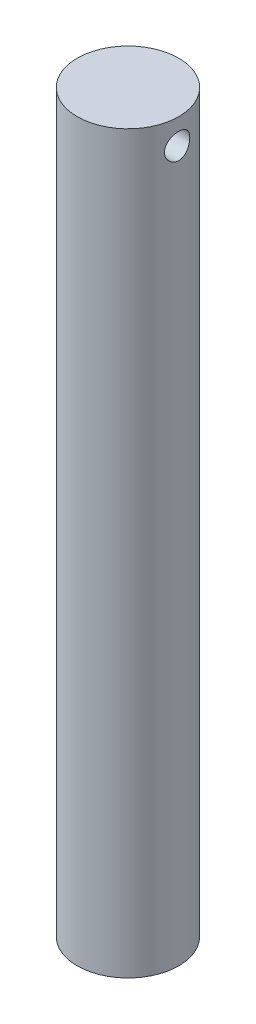
ISO-10303-21;
HEADER;
FILE_DESCRIPTION(('STEP AP214'),'2;1');
FILE_NAME('part.step','',(''),(''),'','','');
FILE_SCHEMA(('AUTOMOTIVE_DESIGN { 1 0 10303 214 1 1 1 1 }'));
ENDSEC;
DATA;
#1=APPLICATION_CONTEXT('core data for automotive mechanical design processes');
#2=APPLICATION_PROTOCOL_DEFINITION('international standard','automotive_design',2000,#1);
#3=PRODUCT_CONTEXT('',#1,'mechanical');
#4=PRODUCT('Part','Part','',(#3));
#5=PRODUCT_RELATED_PRODUCT_CATEGORY('part','',(#4));
#6=PRODUCT_DEFINITION_FORMATION('','',#4);
#7=PRODUCT_DEFINITION_CONTEXT('part definition',#1,'design');
#8=PRODUCT_DEFINITION('design','',#6,#7);
#9=PRODUCT_DEFINITION_SHAPE('','',#8);
#10=(LENGTH_UNIT() NAMED_UNIT(*) SI_UNIT(.MILLI.,.METRE.));
#11=(NAMED_UNIT(*) PLANE_ANGLE_UNIT() SI_UNIT($,.RADIAN.));
#12=(NAMED_UNIT(*) SI_UNIT($,.STERADIAN.) SOLID_ANGLE_UNIT());
#13=UNCERTAINTY_MEASURE_WITH_UNIT(LENGTH_MEASURE(1.E-05),#10,'distance_accuracy_value','');
#14=(GEOMETRIC_REPRESENTATION_CONTEXT(3) GLOBAL_UNCERTAINTY_ASSIGNED_CONTEXT((#13)) GLOBAL_UNIT_ASSIGNED_CONTEXT((#10,
#11,#12)) REPRESENTATION_CONTEXT('',''));
#15=CARTESIAN_POINT('',(0.,0.,0.));
#16=DIRECTION('',(0.,0.,1.));
#17=DIRECTION('',(1.,0.,0.));
#18=AXIS2_PLACEMENT_3D('',#15,#16,#17);
#19=CARTESIAN_POINT('',(0.,184.15,0.));
#20=DIRECTION('',(0.,-1.,0.));
#21=DIRECTION('',(0.,0.,-1.));
#22=AXIS2_PLACEMENT_3D('',#19,#20,#21);
#23=CYLINDRICAL_SURFACE('',#22,12.7);
#24=CARTESIAN_POINT('',(-12.2967221242086,177.8,-3.175));
#25=CARTESIAN_POINT('',(-12.2967254711158,177.975324453677,-3.1749950198132));
#26=CARTESIAN_POINT('',(-12.3005126863854,178.150704021322,-3.160428331782));
#27=CARTESIAN_POINT('',(-12.3152136473056,178.49642682428,-3.10263936933901));
#28=CARTESIAN_POINT('',(-12.3261315404947,178.666767068175,-3.05940041756249));
#29=CARTESIAN_POINT('',(-12.3537818023711,178.997360493498,-2.94575382353269));
#30=CARTESIAN_POINT('',(-12.3705066621688,179.15762638734,-2.87538125437516));
#31=CARTESIAN_POINT('',(-12.4078770387652,179.464094782726,-2.7095718494019));
#32=CARTESIAN_POINT('',(-12.4285227220068,179.610296686842,-2.61413394947205));
#33=CARTESIAN_POINT('',(-12.4719170977164,179.887704289483,-2.39865970268607));
#34=CARTESIAN_POINT('',(-12.4946993898125,180.018554872445,-2.27817284738409));
#35=CARTESIAN_POINT('',(-12.5395085190442,180.258416970838,-2.0169912214078));
#36=CARTESIAN_POINT('',(-12.5615352853931,180.36742644454,-1.87629456360899));
#37=CARTESIAN_POINT('',(-12.6027232771114,180.561964843892,-1.57625440537029));
#38=CARTESIAN_POINT('',(-12.6218402299875,180.647144912965,-1.41667811176779));
#39=CARTESIAN_POINT('',(-12.65467131146,180.789338248074,-1.08491424405177));
#40=CARTESIAN_POINT('',(-12.6683862371462,180.846355669933,-0.91272853495574));
#41=CARTESIAN_POINT('',(-12.6886304373719,180.929467749915,-0.56433562361777));
#42=CARTESIAN_POINT('',(-12.6952996518228,180.956165448295,-0.388280553827184));
#43=CARTESIAN_POINT('',(-12.7011886451627,180.97977314168,-0.0340726004637031));
#44=CARTESIAN_POINT('',(-12.7004095254281,180.976687540706,0.144079969063361));
#45=CARTESIAN_POINT('',(-12.6915938059099,180.941249940182,0.493243384772336));
#46=CARTESIAN_POINT('',(-12.6837186297291,180.909548867182,0.664324984533387));
#47=CARTESIAN_POINT('',(-12.6617836238657,180.818826487038,0.998658935538459));
#48=CARTESIAN_POINT('',(-12.6477234649603,180.759803725571,1.16191086950116));
#49=CARTESIAN_POINT('',(-12.6147513732012,180.615586735228,1.47766628361825));
#50=CARTESIAN_POINT('',(-12.5957967501266,180.53016085328,1.63005931850864));
#51=CARTESIAN_POINT('',(-12.5550917783831,180.335738287522,1.91857510093104));
#52=CARTESIAN_POINT('',(-12.5333409435887,180.226737502928,2.05469501139649));
#53=CARTESIAN_POINT('',(-12.4887191648708,179.984769897682,2.31068256139473));
#54=CARTESIAN_POINT('',(-12.4658338379713,179.851234286718,2.43001063106372));
#55=CARTESIAN_POINT('',(-12.4220610526701,179.565808033604,2.64469999368257));
#56=CARTESIAN_POINT('',(-12.4011736876753,179.413916534046,2.74006016644615));
#57=CARTESIAN_POINT('',(-12.3637103097324,179.095031656631,2.90445230964671));
#58=CARTESIAN_POINT('',(-12.347155693206,178.927968622503,2.97335437513114));
#59=CARTESIAN_POINT('',(-12.3205067298881,178.584116455543,3.08192684552047));
#60=CARTESIAN_POINT('',(-12.3104110007027,178.40732941274,3.12160350580597));
#61=CARTESIAN_POINT('',(-12.2981130212947,178.054051433057,3.16970364110574));
#62=CARTESIAN_POINT('',(-12.295709330007,177.877676002457,3.1789249018773));
#63=CARTESIAN_POINT('',(-12.2985192607316,177.525906140537,3.16803657795425));
#64=CARTESIAN_POINT('',(-12.3037321815428,177.350511620404,3.14792969326922));
#65=CARTESIAN_POINT('',(-12.3209949412093,177.008644883516,3.0796553392016));
#66=CARTESIAN_POINT('',(-12.3329315220801,176.842073637257,3.0319523667181));
#67=CARTESIAN_POINT('',(-12.3621891219376,176.519292048527,2.91035496372155));
#68=CARTESIAN_POINT('',(-12.3795107787294,176.363082935999,2.83645743059486));
#69=CARTESIAN_POINT('',(-12.418010941113,176.062079577109,2.66289874827948));
#70=CARTESIAN_POINT('',(-12.439258441312,175.917569373146,2.56276062737135));
#71=CARTESIAN_POINT('',(-12.4830469550031,175.647110779242,2.34016643006697));
#72=CARTESIAN_POINT('',(-12.5055881806495,175.521165445855,2.21770668600727));
#73=CARTESIAN_POINT('',(-12.5501070185035,175.288179975935,1.95028413912648));
#74=CARTESIAN_POINT('',(-12.5720564161859,175.181691720563,1.80483494928784));
#75=CARTESIAN_POINT('',(-12.6123346509938,174.994651448972,1.49765601755565));
#76=CARTESIAN_POINT('',(-12.6306636769502,174.914098079908,1.33592712544036));
#77=CARTESIAN_POINT('',(-12.6615204698767,174.78191353615,1.00189729049619));
#78=CARTESIAN_POINT('',(-12.6740898412846,174.730074358839,0.829682684763512));
#79=CARTESIAN_POINT('',(-12.6921932261265,174.656165375047,0.478630489012205));
#80=CARTESIAN_POINT('',(-12.6977285972965,174.634089823401,0.299794184005929));
#81=CARTESIAN_POINT('',(-12.7010848787296,174.620657903098,-0.0542401964575542));
#82=CARTESIAN_POINT('',(-12.6991103294396,174.628487073622,-0.229405900617113));
#83=CARTESIAN_POINT('',(-12.6881222125238,174.67277685166,-0.575841801116832));
#84=CARTESIAN_POINT('',(-12.6791088542401,174.709236607667,-0.74711211315446));
#85=CARTESIAN_POINT('',(-12.655087493111,174.809315797772,-1.0800430381722));
#86=CARTESIAN_POINT('',(-12.640112022951,174.872787964273,-1.24175042029429));
#87=CARTESIAN_POINT('',(-12.6057434230086,175.024956588387,-1.55231164340718));
#88=CARTESIAN_POINT('',(-12.5863497364056,175.113656225729,-1.70116386101836));
#89=CARTESIAN_POINT('',(-12.5446551773491,175.316245867938,-1.98565112274399));
#90=CARTESIAN_POINT('',(-12.5222957878978,175.43068845372,-2.12088408784728));
#91=CARTESIAN_POINT('',(-12.4774531075658,175.680442555028,-2.37050268936846));
#92=CARTESIAN_POINT('',(-12.4549697867118,175.815759353653,-2.48488303211821));
#93=CARTESIAN_POINT('',(-12.4119473580947,176.106459490052,-2.69164443404806));
#94=CARTESIAN_POINT('',(-12.3914523466269,176.262170091685,-2.783575266647));
#95=CARTESIAN_POINT('',(-12.3553205869608,176.587326180353,-2.93981789665887));
#96=CARTESIAN_POINT('',(-12.3396803064045,176.756761567348,-3.00414978846308));
#97=CARTESIAN_POINT('',(-12.3174731028359,177.071582012577,-3.09379152821293));
#98=CARTESIAN_POINT('',(-12.3097500503611,177.215460796926,-3.12417831664509));
#99=CARTESIAN_POINT('',(-12.2993733749982,177.506213659068,-3.16478377891537));
#100=CARTESIAN_POINT('',(-12.2967193196792,177.653087480276,-3.17500417313031));
#101=CARTESIAN_POINT('',(-12.2967221242086,177.8,-3.175));
#102=B_SPLINE_CURVE_WITH_KNOTS('',3,(#24,#25,#26,#27,#28,#29,#30,#31,#32,#33,#34,#35,#36,#37,
#38,#39,#40,#41,#42,#43,#44,#45,#46,#47,#48,#49,#50,#51,#52,#53,#54,#55,#56,#57,#58,#59,#60,#61,
#62,#63,#64,#65,#66,#67,#68,#69,#70,#71,#72,#73,#74,#75,#76,#77,#78,#79,#80,#81,#82,#83,#84,#85,
#86,#87,#88,#89,#90,#91,#92,#93,#94,#95,#96,#97,#98,#99,#100,#101),.UNSPECIFIED.,.T.,.F.,(4,2,2,
2,2,2,2,2,2,2,2,2,2,2,2,2,2,2,2,2,2,2,2,2,2,2,2,2,2,2,2,2,2,2,2,2,2,2,4),(0.,0.525433851004991,
1.05117359161457,1.57623602350094,2.10132074979464,2.63682421825087,3.17237772279439,
3.71540400425363,4.2583501300581,4.79029713764094,5.32216548805849,5.84223193614965,
6.36232607040479,6.88711950303146,7.41200429545524,7.95109492546326,8.49021074623747,
9.03194068650662,9.57355464164508,10.1008633995052,10.6281236152969,11.1467570436795,
11.6654519221146,12.194322142474,12.7232793399028,13.2654717033223,13.8076357797011,
14.3458193247108,14.8838989712076,15.4074297658815,15.9309449907504,16.4516419323712,
16.9724045329365,17.5056431266552,18.0390169009448,18.5823412615974,19.1252693614627,
19.5655924052587,20.0058778838705),.UNSPECIFIED.);
#103=CARTESIAN_POINT('',(-12.2967221242086,177.8,-3.175));
#104=VERTEX_POINT('',#103);
#105=EDGE_CURVE('E10',#104,#104,#102,.T.);
#106=ORIENTED_EDGE('',*,*,#105,.T.);
#107=EDGE_LOOP('',(#106));
#108=FACE_BOUND('',#107,.T.);
#109=CARTESIAN_POINT('',(12.2967221242086,177.8,-3.175));
#110=CARTESIAN_POINT('',(12.2967254711158,177.624675546323,-3.1749950198132));
#111=CARTESIAN_POINT('',(12.3005126863854,177.449295978678,-3.160428331782));
#112=CARTESIAN_POINT('',(12.3152136473056,177.10357317572,-3.10263936933901));
#113=CARTESIAN_POINT('',(12.3261315404947,176.933232931825,-3.05940041756249));
#114=CARTESIAN_POINT('',(12.3537818023711,176.602639506502,-2.94575382353269));
#115=CARTESIAN_POINT('',(12.3705066621688,176.44237361266,-2.87538125437516));
#116=CARTESIAN_POINT('',(12.4078770387652,176.135905217274,-2.7095718494019));
#117=CARTESIAN_POINT('',(12.4285227220068,175.989703313158,-2.61413394947205));
#118=CARTESIAN_POINT('',(12.4719170977164,175.712295710517,-2.39865970268606));
#119=CARTESIAN_POINT('',(12.4946993898125,175.581445127555,-2.27817284738408));
#120=CARTESIAN_POINT('',(12.5395085190442,175.341583029162,-2.01699122140779));
#121=CARTESIAN_POINT('',(12.5615352853931,175.23257355546,-1.87629456360899));
#122=CARTESIAN_POINT('',(12.6027232771114,175.038035156108,-1.57625440537029));
#123=CARTESIAN_POINT('',(12.6218402299875,174.952855087035,-1.41667811176778));
#124=CARTESIAN_POINT('',(12.65467131146,174.810661751926,-1.08491424405177));
#125=CARTESIAN_POINT('',(12.6683862371462,174.753644330067,-0.912728534955738));
#126=CARTESIAN_POINT('',(12.6886304373719,174.670532250085,-0.564335623617774));
#127=CARTESIAN_POINT('',(12.6952996518228,174.643834551705,-0.388280553827185));
#128=CARTESIAN_POINT('',(12.7011886451627,174.62022685832,-0.0340726004637008));
#129=CARTESIAN_POINT('',(12.7004095254281,174.623312459294,0.144079969063363));
#130=CARTESIAN_POINT('',(12.6915938059099,174.658750059818,0.493243384772331));
#131=CARTESIAN_POINT('',(12.6837186297291,174.690451132818,0.664324984533374));
#132=CARTESIAN_POINT('',(12.6617836238657,174.781173512962,0.998658935538448));
#133=CARTESIAN_POINT('',(12.6477234649603,174.840196274429,1.16191086950116));
#134=CARTESIAN_POINT('',(12.6147513732012,174.984413264772,1.47766628361824));
#135=CARTESIAN_POINT('',(12.5957967501266,175.06983914672,1.63005931850862));
#136=CARTESIAN_POINT('',(12.5550917783831,175.264261712478,1.91857510093102));
#137=CARTESIAN_POINT('',(12.5333409435887,175.373262497072,2.05469501139649));
#138=CARTESIAN_POINT('',(12.4887191648708,175.615230102318,2.31068256139474));
#139=CARTESIAN_POINT('',(12.4658338379713,175.748765713282,2.43001063106372));
#140=CARTESIAN_POINT('',(12.4220610526701,176.034191966396,2.64469999368256));
#141=CARTESIAN_POINT('',(12.4011736876753,176.186083465954,2.74006016644615));
#142=CARTESIAN_POINT('',(12.3637103097323,176.504968343369,2.90445230964676));
#143=CARTESIAN_POINT('',(12.347155693206,176.672031377497,2.97335437513121));
#144=CARTESIAN_POINT('',(12.3205067298881,177.015883544458,3.08192684552053));
#145=CARTESIAN_POINT('',(12.3104110007027,177.192670587261,3.12160350580599));
#146=CARTESIAN_POINT('',(12.2981130212947,177.545948566943,3.16970364110571));
#147=CARTESIAN_POINT('',(12.2957093300071,177.722323997543,3.17892490187727));
#148=CARTESIAN_POINT('',(12.2985192607316,178.074093859464,3.16803657795425));
#149=CARTESIAN_POINT('',(12.3037321815428,178.249488379596,3.14792969326927));
#150=CARTESIAN_POINT('',(12.3209949412093,178.591355116485,3.07965533920156));
#151=CARTESIAN_POINT('',(12.3329315220802,178.757926362743,3.03195236671794));
#152=CARTESIAN_POINT('',(12.3621891219376,179.080707951474,2.91035496372141));
#153=CARTESIAN_POINT('',(12.3795107787294,179.236917064001,2.83645743059486));
#154=CARTESIAN_POINT('',(12.418010941113,179.537920422891,2.66289874827951));
#155=CARTESIAN_POINT('',(12.439258441312,179.682430626855,2.56276062737127));
#156=CARTESIAN_POINT('',(12.4830469550031,179.952889220758,2.34016643006686));
#157=CARTESIAN_POINT('',(12.5055881806495,180.078834554145,2.21770668600722));
#158=CARTESIAN_POINT('',(12.5501070185035,180.311820024065,1.95028413912649));
#159=CARTESIAN_POINT('',(12.5720564161859,180.418308279437,1.80483494928784));
#160=CARTESIAN_POINT('',(12.6123346509939,180.605348551028,1.49765601755564));
#161=CARTESIAN_POINT('',(12.6306636769502,180.685901920092,1.33592712544036));
#162=CARTESIAN_POINT('',(12.6615204698767,180.81808646385,1.00189729049619));
#163=CARTESIAN_POINT('',(12.6740898412846,180.869925641161,0.829682684763504));
#164=CARTESIAN_POINT('',(12.6921932261265,180.943834624953,0.478630489012196));
#165=CARTESIAN_POINT('',(12.6977285972965,180.965910176599,0.299794184005925));
#166=CARTESIAN_POINT('',(12.7010848787296,180.979342096903,-0.0542401964575463));
#167=CARTESIAN_POINT('',(12.6991103294396,180.971512926378,-0.229405900617098));
#168=CARTESIAN_POINT('',(12.6881222125238,180.92722314834,-0.575841801116821));
#169=CARTESIAN_POINT('',(12.6791088542401,180.890763392333,-0.747112113154459));
#170=CARTESIAN_POINT('',(12.655087493111,180.790684202228,-1.08004303817215));
#171=CARTESIAN_POINT('',(12.640112022951,180.727212035727,-1.2417504202942));
#172=CARTESIAN_POINT('',(12.6057434230086,180.575043411613,-1.55231164340713));
#173=CARTESIAN_POINT('',(12.5863497364055,180.486343774271,-1.70116386101841));
#174=CARTESIAN_POINT('',(12.5446551773491,180.283754132063,-1.98565112274402));
#175=CARTESIAN_POINT('',(12.5222957878979,180.16931154628,-2.12088408784719));
#176=CARTESIAN_POINT('',(12.4774531075658,179.919557444972,-2.37050268936833));
#177=CARTESIAN_POINT('',(12.4549697867119,179.784240646347,-2.48488303211816));
#178=CARTESIAN_POINT('',(12.4119473580947,179.493540509948,-2.69164443404808));
#179=CARTESIAN_POINT('',(12.3914523466269,179.337829908315,-2.78357526664703));
#180=CARTESIAN_POINT('',(12.3553205869608,179.012673819647,-2.93981789665889));
#181=CARTESIAN_POINT('',(12.3396803064045,178.843238432652,-3.00414978846308));
#182=CARTESIAN_POINT('',(12.3174731028359,178.528417987423,-3.09379152821293));
#183=CARTESIAN_POINT('',(12.3097500503611,178.384539203074,-3.12417831664509));
#184=CARTESIAN_POINT('',(12.2993733749982,178.093786340932,-3.16478377891537));
#185=CARTESIAN_POINT('',(12.2967193196792,177.946912519724,-3.17500417313031));
#186=CARTESIAN_POINT('',(12.2967221242086,177.8,-3.175));
#187=B_SPLINE_CURVE_WITH_KNOTS('',3,(#109,#110,#111,#112,#113,#114,#115,#116,#117,#118,#119,
#120,#121,#122,#123,#124,#125,#126,#127,#128,#129,#130,#131,#132,#133,#134,#135,#136,#137,#138,
#139,#140,#141,#142,#143,#144,#145,#146,#147,#148,#149,#150,#151,#152,#153,#154,#155,#156,#157,
#158,#159,#160,#161,#162,#163,#164,#165,#166,#167,#168,#169,#170,#171,#172,#173,#174,#175,#176,
#177,#178,#179,#180,#181,#182,#183,#184,#185,#186),.UNSPECIFIED.,.T.,.F.,(4,2,2,2,2,2,2,2,2,2,2,
2,2,2,2,2,2,2,2,2,2,2,2,2,2,2,2,2,2,2,2,2,2,2,2,2,2,2,4),(0.,0.525433851004991,1.05117359161457,
1.57623602350094,2.10132074979464,2.6368242182509,3.17237772279441,3.71540400425364,
4.25835013005812,4.79029713764095,5.3221654880585,5.84223193614965,6.36232607040479,
6.88711950303145,7.41200429545523,7.95109492546329,8.49021074623746,9.03194068650686,
9.57355464164558,10.1008633995057,10.6281236152974,11.14675704368,11.665451922115,
12.1943221424742,12.7232793399028,13.2654717033224,13.8076357797012,14.3458193247109,
14.8838989712077,15.4074297658816,15.9309449907505,16.4516419323712,16.9724045329363,
17.5056431266552,18.0390169009449,18.5823412615976,19.1252693614629,19.5655924052588,
20.0058778838707),.UNSPECIFIED.);
#188=CARTESIAN_POINT('',(12.2967221242086,177.8,-3.175));
#189=VERTEX_POINT('',#188);
#190=EDGE_CURVE('E25',#189,#189,#187,.T.);
#191=ORIENTED_EDGE('',*,*,#190,.T.);
#192=EDGE_LOOP('',(#191));
#193=FACE_BOUND('',#192,.T.);
#194=CARTESIAN_POINT('',(0.,184.15,0.));
#195=DIRECTION('',(0.,1.,0.));
#196=DIRECTION('',(0.,0.,1.));
#197=AXIS2_PLACEMENT_3D('',#194,#195,#196);
#198=CIRCLE('',#197,12.7);
#199=CARTESIAN_POINT('',(0.,184.15,12.7));
#200=VERTEX_POINT('',#199);
#201=EDGE_CURVE('E29',#200,#200,#198,.T.);
#202=ORIENTED_EDGE('',*,*,#201,.F.);
#203=EDGE_LOOP('',(#202));
#204=FACE_BOUND('',#203,.T.);
#205=CARTESIAN_POINT('',(0.,0.,0.));
#206=DIRECTION('',(0.,1.,0.));
#207=DIRECTION('',(0.,0.,1.));
#208=AXIS2_PLACEMENT_3D('',#205,#206,#207);
#209=CIRCLE('',#208,12.7);
#210=CARTESIAN_POINT('',(0.,0.,12.7));
#211=VERTEX_POINT('',#210);
#212=EDGE_CURVE('E33',#211,#211,#209,.T.);
#213=ORIENTED_EDGE('',*,*,#212,.T.);
#214=EDGE_LOOP('',(#213));
#215=FACE_BOUND('',#214,.T.);
#216=ADVANCED_FACE('F15',(#108,#193,#204,#215),#23,.T.);
#217=CARTESIAN_POINT('',(0.,184.15,0.));
#218=DIRECTION('',(0.,1.,0.));
#219=DIRECTION('',(0.,0.,1.));
#220=AXIS2_PLACEMENT_3D('',#217,#218,#219);
#221=PLANE('',#220);
#222=ORIENTED_EDGE('',*,*,#201,.T.);
#223=EDGE_LOOP('',(#222));
#224=FACE_BOUND('',#223,.T.);
#225=ADVANCED_FACE('F44',(#224),#221,.T.);
#226=CARTESIAN_POINT('',(0.,0.,0.));
#227=DIRECTION('',(0.,1.,0.));
#228=DIRECTION('',(0.,0.,1.));
#229=AXIS2_PLACEMENT_3D('',#226,#227,#228);
#230=PLANE('',#229);
#231=ORIENTED_EDGE('',*,*,#212,.F.);
#232=EDGE_LOOP('',(#231));
#233=FACE_BOUND('',#232,.T.);
#234=ADVANCED_FACE('F42',(#233),#230,.F.);
#235=CARTESIAN_POINT('',(-12.7,177.8,0.));
#236=DIRECTION('',(1.,0.,0.));
#237=DIRECTION('',(0.,0.,-1.));
#238=AXIS2_PLACEMENT_3D('',#235,#236,#237);
#239=CYLINDRICAL_SURFACE('',#238,3.175);
#240=ORIENTED_EDGE('',*,*,#190,.F.);
#241=EDGE_LOOP('',(#240));
#242=FACE_BOUND('',#241,.T.);
#243=ORIENTED_EDGE('',*,*,#105,.F.);
#244=EDGE_LOOP('',(#243));
#245=FACE_BOUND('',#244,.T.);
#246=ADVANCED_FACE('F38',(#242,#245),#239,.F.);
#247=CLOSED_SHELL('',(#216,#225,#234,#246));
#248=MANIFOLD_SOLID_BREP('B1',#247);
#249=ADVANCED_BREP_SHAPE_REPRESENTATION('',(#18,#248),#14);
#250=SHAPE_DEFINITION_REPRESENTATION(#9,#249);
ENDSEC;
END-ISO-10303-21;
